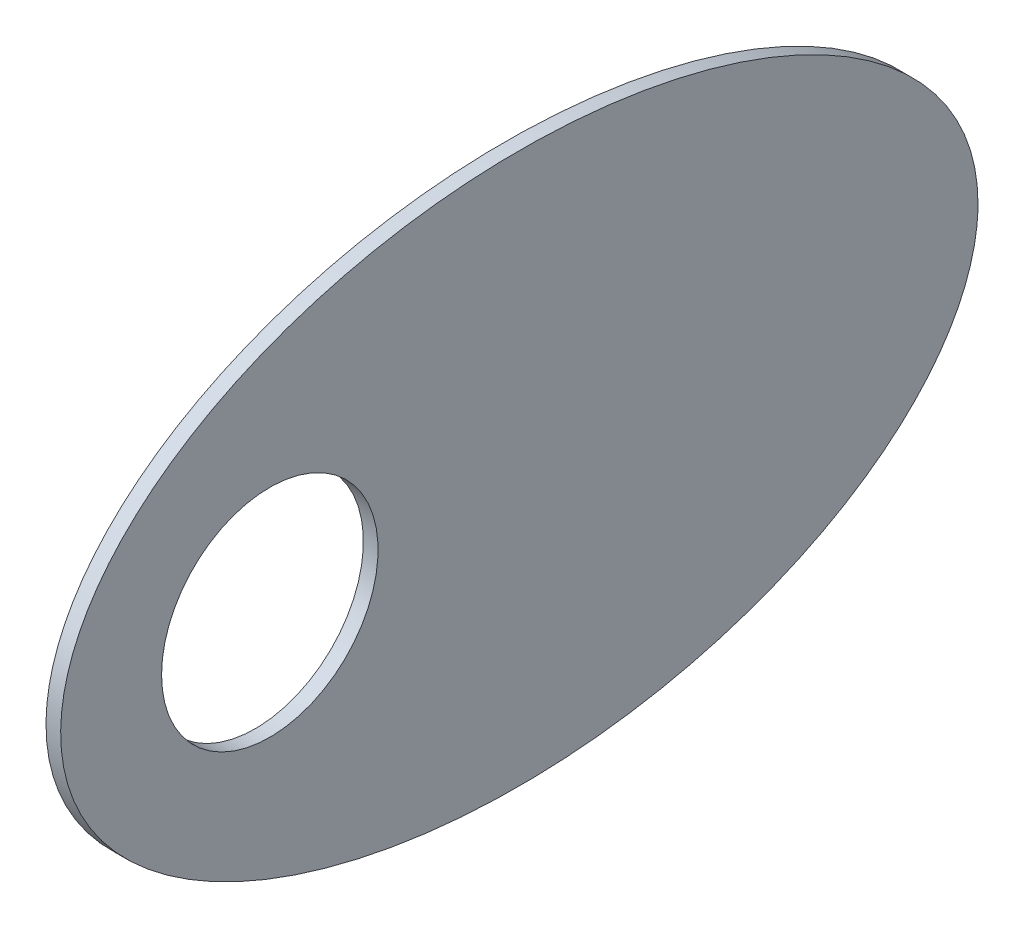
ISO-10303-21;
HEADER;
FILE_DESCRIPTION(('STEP AP214'),'2;1');
FILE_NAME('part.step','',(''),(''),'','','');
FILE_SCHEMA(('AUTOMOTIVE_DESIGN { 1 0 10303 214 1 1 1 1 }'));
ENDSEC;
DATA;
#1=APPLICATION_CONTEXT('core data for automotive mechanical design processes');
#2=APPLICATION_PROTOCOL_DEFINITION('international standard','automotive_design',2000,#1);
#3=PRODUCT_CONTEXT('',#1,'mechanical');
#4=PRODUCT('Part','Part','',(#3));
#5=PRODUCT_RELATED_PRODUCT_CATEGORY('part','',(#4));
#6=PRODUCT_DEFINITION_FORMATION('','',#4);
#7=PRODUCT_DEFINITION_CONTEXT('part definition',#1,'design');
#8=PRODUCT_DEFINITION('design','',#6,#7);
#9=PRODUCT_DEFINITION_SHAPE('','',#8);
#10=(LENGTH_UNIT() NAMED_UNIT(*) SI_UNIT(.MILLI.,.METRE.));
#11=(NAMED_UNIT(*) PLANE_ANGLE_UNIT() SI_UNIT($,.RADIAN.));
#12=(NAMED_UNIT(*) SI_UNIT($,.STERADIAN.) SOLID_ANGLE_UNIT());
#13=UNCERTAINTY_MEASURE_WITH_UNIT(LENGTH_MEASURE(1.E-05),#10,'distance_accuracy_value','');
#14=(GEOMETRIC_REPRESENTATION_CONTEXT(3) GLOBAL_UNCERTAINTY_ASSIGNED_CONTEXT((#13)) GLOBAL_UNIT_ASSIGNED_CONTEXT((#10,
#11,#12)) REPRESENTATION_CONTEXT('',''));
#15=CARTESIAN_POINT('',(0.,0.,0.));
#16=DIRECTION('',(0.,0.,1.));
#17=DIRECTION('',(1.,0.,0.));
#18=AXIS2_PLACEMENT_3D('',#15,#16,#17);
#19=CARTESIAN_POINT('',(4.,0.,0.));
#20=DIRECTION('',(1.,0.,0.));
#21=DIRECTION('',(0.,0.,-1.));
#22=AXIS2_PLACEMENT_3D('',#19,#20,#21);
#23=ELLIPSE('',#22,125.,75.);
#24=DIRECTION('',(-1.,0.,0.));
#25=VECTOR('',#24,1.);
#26=SURFACE_OF_LINEAR_EXTRUSION('',#23,#25);
#27=CARTESIAN_POINT('',(4.,0.,-125.));
#28=VERTEX_POINT('',#27);
#29=EDGE_CURVE('E10',#28,#28,#23,.T.);
#30=ORIENTED_EDGE('',*,*,#29,.F.);
#31=EDGE_LOOP('',(#30));
#32=FACE_BOUND('',#31,.T.);
#33=CARTESIAN_POINT('',(0.,0.,0.));
#34=DIRECTION('',(1.,0.,0.));
#35=DIRECTION('',(0.,0.,-1.));
#36=AXIS2_PLACEMENT_3D('',#33,#34,#35);
#37=ELLIPSE('',#36,125.,75.);
#38=CARTESIAN_POINT('',(0.,0.,-125.));
#39=VERTEX_POINT('',#38);
#40=EDGE_CURVE('E35',#39,#39,#37,.T.);
#41=ORIENTED_EDGE('',*,*,#40,.T.);
#42=EDGE_LOOP('',(#41));
#43=FACE_BOUND('',#42,.T.);
#44=ADVANCED_FACE('F31',(#32,#43),#26,.F.);
#45=CARTESIAN_POINT('',(4.,0.,0.));
#46=DIRECTION('',(1.,0.,0.));
#47=DIRECTION('',(0.,0.,-1.));
#48=AXIS2_PLACEMENT_3D('',#45,#46,#47);
#49=PLANE('',#48);
#50=CARTESIAN_POINT('',(4.,0.,68.));
#51=DIRECTION('',(-1.,0.,0.));
#52=DIRECTION('',(0.,0.,1.));
#53=AXIS2_PLACEMENT_3D('',#50,#51,#52);
#54=CIRCLE('',#53,29.5);
#55=CARTESIAN_POINT('',(4.,0.,97.5));
#56=VERTEX_POINT('',#55);
#57=EDGE_CURVE('E41',#56,#56,#54,.T.);
#58=ORIENTED_EDGE('',*,*,#57,.T.);
#59=EDGE_LOOP('',(#58));
#60=FACE_BOUND('',#59,.T.);
#61=ORIENTED_EDGE('',*,*,#29,.T.);
#62=EDGE_LOOP('',(#61));
#63=FACE_BOUND('',#62,.T.);
#64=ADVANCED_FACE('F50',(#60,#63),#49,.T.);
#65=CARTESIAN_POINT('',(0.,0.,0.));
#66=DIRECTION('',(1.,0.,0.));
#67=DIRECTION('',(0.,0.,-1.));
#68=AXIS2_PLACEMENT_3D('',#65,#66,#67);
#69=PLANE('',#68);
#70=CARTESIAN_POINT('',(0.,0.,68.));
#71=DIRECTION('',(-1.,0.,0.));
#72=DIRECTION('',(0.,0.,1.));
#73=AXIS2_PLACEMENT_3D('',#70,#71,#72);
#74=CIRCLE('',#73,29.5);
#75=CARTESIAN_POINT('',(0.,0.,97.5));
#76=VERTEX_POINT('',#75);
#77=EDGE_CURVE('E44',#76,#76,#74,.T.);
#78=ORIENTED_EDGE('',*,*,#77,.F.);
#79=EDGE_LOOP('',(#78));
#80=FACE_BOUND('',#79,.T.);
#81=ORIENTED_EDGE('',*,*,#40,.F.);
#82=EDGE_LOOP('',(#81));
#83=FACE_BOUND('',#82,.T.);
#84=ADVANCED_FACE('F55',(#80,#83),#69,.F.);
#85=CARTESIAN_POINT('',(4.,0.,68.));
#86=DIRECTION('',(-1.,0.,0.));
#87=DIRECTION('',(0.,0.,1.));
#88=AXIS2_PLACEMENT_3D('',#85,#86,#87);
#89=CYLINDRICAL_SURFACE('',#88,29.5);
#90=ORIENTED_EDGE('',*,*,#57,.F.);
#91=EDGE_LOOP('',(#90));
#92=FACE_BOUND('',#91,.T.);
#93=ORIENTED_EDGE('',*,*,#77,.T.);
#94=EDGE_LOOP('',(#93));
#95=FACE_BOUND('',#94,.T.);
#96=ADVANCED_FACE('F52',(#92,#95),#89,.F.);
#97=CLOSED_SHELL('',(#44,#64,#84,#96));
#98=MANIFOLD_SOLID_BREP('B2',#97);
#99=ADVANCED_BREP_SHAPE_REPRESENTATION('',(#18,#98),#14);
#100=SHAPE_DEFINITION_REPRESENTATION(#9,#99);
ENDSEC;
END-ISO-10303-21;
